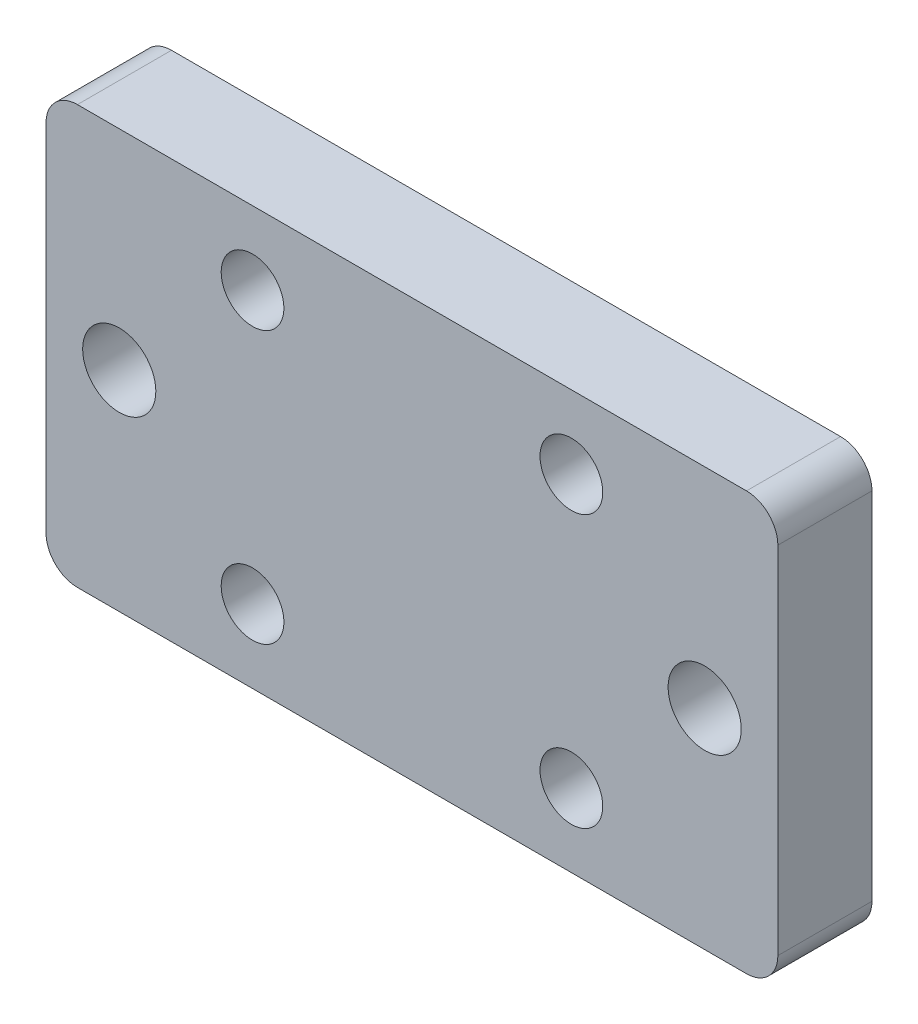
ISO-10303-21;
HEADER;
FILE_DESCRIPTION(('STEP AP214'),'2;1');
FILE_NAME('part.step','',(''),(''),'','','');
FILE_SCHEMA(('AUTOMOTIVE_DESIGN { 1 0 10303 214 1 1 1 1 }'));
ENDSEC;
DATA;
#1=APPLICATION_CONTEXT('core data for automotive mechanical design processes');
#2=APPLICATION_PROTOCOL_DEFINITION('international standard','automotive_design',2000,#1);
#3=PRODUCT_CONTEXT('',#1,'mechanical');
#4=PRODUCT('Part','Part','',(#3));
#5=PRODUCT_RELATED_PRODUCT_CATEGORY('part','',(#4));
#6=PRODUCT_DEFINITION_FORMATION('','',#4);
#7=PRODUCT_DEFINITION_CONTEXT('part definition',#1,'design');
#8=PRODUCT_DEFINITION('design','',#6,#7);
#9=PRODUCT_DEFINITION_SHAPE('','',#8);
#10=(LENGTH_UNIT() NAMED_UNIT(*) SI_UNIT(.MILLI.,.METRE.));
#11=(NAMED_UNIT(*) PLANE_ANGLE_UNIT() SI_UNIT($,.RADIAN.));
#12=(NAMED_UNIT(*) SI_UNIT($,.STERADIAN.) SOLID_ANGLE_UNIT());
#13=UNCERTAINTY_MEASURE_WITH_UNIT(LENGTH_MEASURE(1.E-05),#10,'distance_accuracy_value','');
#14=(GEOMETRIC_REPRESENTATION_CONTEXT(3) GLOBAL_UNCERTAINTY_ASSIGNED_CONTEXT((#13)) GLOBAL_UNIT_ASSIGNED_CONTEXT((#10,
#11,#12)) REPRESENTATION_CONTEXT('',''));
#15=CARTESIAN_POINT('',(0.,0.,0.));
#16=DIRECTION('',(0.,0.,1.));
#17=DIRECTION('',(1.,0.,0.));
#18=AXIS2_PLACEMENT_3D('',#15,#16,#17);
#19=CARTESIAN_POINT('',(0.,0.,9.));
#20=DIRECTION('',(1.,0.,0.));
#21=DIRECTION('',(0.,0.,-1.));
#22=AXIS2_PLACEMENT_3D('',#19,#20,#21);
#23=PLANE('',#22);
#24=DIRECTION('',(0.,-1.,0.));
#25=VECTOR('',#24,1.);
#26=CARTESIAN_POINT('',(0.,0.,9.));
#27=LINE('',#26,#25);
#28=CARTESIAN_POINT('',(0.,37.,9.));
#29=VERTEX_POINT('',#28);
#30=CARTESIAN_POINT('',(0.,3.,9.));
#31=VERTEX_POINT('',#30);
#32=EDGE_CURVE('E118',#29,#31,#27,.T.);
#33=ORIENTED_EDGE('',*,*,#32,.F.);
#34=DIRECTION('',(0.,0.,-1.));
#35=VECTOR('',#34,1.);
#36=CARTESIAN_POINT('',(0.,37.,9.));
#37=LINE('',#36,#35);
#38=CARTESIAN_POINT('',(0.,37.,0.));
#39=VERTEX_POINT('',#38);
#40=EDGE_CURVE('E103',#29,#39,#37,.T.);
#41=ORIENTED_EDGE('',*,*,#40,.T.);
#42=DIRECTION('',(0.,-1.,0.));
#43=VECTOR('',#42,1.);
#44=CARTESIAN_POINT('',(0.,0.,0.));
#45=LINE('',#44,#43);
#46=CARTESIAN_POINT('',(0.,3.,0.));
#47=VERTEX_POINT('',#46);
#48=EDGE_CURVE('E115',#39,#47,#45,.T.);
#49=ORIENTED_EDGE('',*,*,#48,.T.);
#50=DIRECTION('',(0.,0.,-1.));
#51=VECTOR('',#50,1.);
#52=CARTESIAN_POINT('',(0.,3.,9.));
#53=LINE('',#52,#51);
#54=EDGE_CURVE('E120',#47,#31,#53,.F.);
#55=ORIENTED_EDGE('',*,*,#54,.T.);
#56=EDGE_LOOP('',(#33,#41,#49,#55));
#57=FACE_BOUND('',#56,.T.);
#58=ADVANCED_FACE('F33',(#57),#23,.F.);
#59=CARTESIAN_POINT('',(0.,0.,9.));
#60=DIRECTION('',(0.,1.,0.));
#61=DIRECTION('',(0.,0.,1.));
#62=AXIS2_PLACEMENT_3D('',#59,#60,#61);
#63=PLANE('',#62);
#64=DIRECTION('',(1.,0.,0.));
#65=VECTOR('',#64,1.);
#66=CARTESIAN_POINT('',(0.,0.,0.));
#67=LINE('',#66,#65);
#68=CARTESIAN_POINT('',(3.,0.,0.));
#69=VERTEX_POINT('',#68);
#70=CARTESIAN_POINT('',(67.,0.,0.));
#71=VERTEX_POINT('',#70);
#72=EDGE_CURVE('E124',#69,#71,#67,.T.);
#73=ORIENTED_EDGE('',*,*,#72,.T.);
#74=DIRECTION('',(0.,0.,-1.));
#75=VECTOR('',#74,1.);
#76=CARTESIAN_POINT('',(67.,0.,9.));
#77=LINE('',#76,#75);
#78=CARTESIAN_POINT('',(67.,0.,9.));
#79=VERTEX_POINT('',#78);
#80=EDGE_CURVE('E11',#71,#79,#77,.F.);
#81=ORIENTED_EDGE('',*,*,#80,.T.);
#82=DIRECTION('',(1.,0.,0.));
#83=VECTOR('',#82,1.);
#84=CARTESIAN_POINT('',(0.,0.,9.));
#85=LINE('',#84,#83);
#86=CARTESIAN_POINT('',(3.,0.,9.));
#87=VERTEX_POINT('',#86);
#88=EDGE_CURVE('E164',#87,#79,#85,.T.);
#89=ORIENTED_EDGE('',*,*,#88,.F.);
#90=DIRECTION('',(0.,0.,-1.));
#91=VECTOR('',#90,1.);
#92=CARTESIAN_POINT('',(3.,0.,9.));
#93=LINE('',#92,#91);
#94=EDGE_CURVE('E41',#87,#69,#93,.T.);
#95=ORIENTED_EDGE('',*,*,#94,.T.);
#96=EDGE_LOOP('',(#73,#81,#89,#95));
#97=FACE_BOUND('',#96,.T.);
#98=ADVANCED_FACE('F162',(#97),#63,.F.);
#99=CARTESIAN_POINT('',(70.,0.,9.));
#100=DIRECTION('',(-1.,0.,0.));
#101=DIRECTION('',(0.,0.,1.));
#102=AXIS2_PLACEMENT_3D('',#99,#100,#101);
#103=PLANE('',#102);
#104=DIRECTION('',(0.,1.,0.));
#105=VECTOR('',#104,1.);
#106=CARTESIAN_POINT('',(70.,0.,0.));
#107=LINE('',#106,#105);
#108=CARTESIAN_POINT('',(70.,3.,0.));
#109=VERTEX_POINT('',#108);
#110=CARTESIAN_POINT('',(70.,37.,0.));
#111=VERTEX_POINT('',#110);
#112=EDGE_CURVE('E128',#109,#111,#107,.T.);
#113=ORIENTED_EDGE('',*,*,#112,.T.);
#114=DIRECTION('',(0.,0.,-1.));
#115=VECTOR('',#114,1.);
#116=CARTESIAN_POINT('',(70.,37.,9.));
#117=LINE('',#116,#115);
#118=CARTESIAN_POINT('',(70.,37.,9.));
#119=VERTEX_POINT('',#118);
#120=EDGE_CURVE('E48',#111,#119,#117,.F.);
#121=ORIENTED_EDGE('',*,*,#120,.T.);
#122=DIRECTION('',(0.,1.,0.));
#123=VECTOR('',#122,1.);
#124=CARTESIAN_POINT('',(70.,0.,9.));
#125=LINE('',#124,#123);
#126=CARTESIAN_POINT('',(70.,3.,9.));
#127=VERTEX_POINT('',#126);
#128=EDGE_CURVE('E172',#127,#119,#125,.T.);
#129=ORIENTED_EDGE('',*,*,#128,.F.);
#130=DIRECTION('',(0.,0.,-1.));
#131=VECTOR('',#130,1.);
#132=CARTESIAN_POINT('',(70.,3.,9.));
#133=LINE('',#132,#131);
#134=EDGE_CURVE('E155',#127,#109,#133,.T.);
#135=ORIENTED_EDGE('',*,*,#134,.T.);
#136=EDGE_LOOP('',(#113,#121,#129,#135));
#137=FACE_BOUND('',#136,.T.);
#138=ADVANCED_FACE('F171',(#137),#103,.F.);
#139=CARTESIAN_POINT('',(0.,40.,9.));
#140=DIRECTION('',(0.,-1.,0.));
#141=DIRECTION('',(0.,0.,-1.));
#142=AXIS2_PLACEMENT_3D('',#139,#140,#141);
#143=PLANE('',#142);
#144=DIRECTION('',(-1.,0.,0.));
#145=VECTOR('',#144,1.);
#146=CARTESIAN_POINT('',(0.,40.,0.));
#147=LINE('',#146,#145);
#148=CARTESIAN_POINT('',(67.,40.,0.));
#149=VERTEX_POINT('',#148);
#150=CARTESIAN_POINT('',(3.,40.,0.));
#151=VERTEX_POINT('',#150);
#152=EDGE_CURVE('E138',#149,#151,#147,.T.);
#153=ORIENTED_EDGE('',*,*,#152,.T.);
#154=DIRECTION('',(0.,0.,-1.));
#155=VECTOR('',#154,1.);
#156=CARTESIAN_POINT('',(3.,40.,9.));
#157=LINE('',#156,#155);
#158=CARTESIAN_POINT('',(3.,40.,9.));
#159=VERTEX_POINT('',#158);
#160=EDGE_CURVE('E104',#151,#159,#157,.F.);
#161=ORIENTED_EDGE('',*,*,#160,.T.);
#162=DIRECTION('',(-1.,0.,0.));
#163=VECTOR('',#162,1.);
#164=CARTESIAN_POINT('',(0.,40.,9.));
#165=LINE('',#164,#163);
#166=CARTESIAN_POINT('',(67.,40.,9.));
#167=VERTEX_POINT('',#166);
#168=EDGE_CURVE('E134',#167,#159,#165,.T.);
#169=ORIENTED_EDGE('',*,*,#168,.F.);
#170=DIRECTION('',(0.,0.,-1.));
#171=VECTOR('',#170,1.);
#172=CARTESIAN_POINT('',(67.,40.,9.));
#173=LINE('',#172,#171);
#174=EDGE_CURVE('E109',#167,#149,#173,.T.);
#175=ORIENTED_EDGE('',*,*,#174,.T.);
#176=EDGE_LOOP('',(#153,#161,#169,#175));
#177=FACE_BOUND('',#176,.T.);
#178=ADVANCED_FACE('F224',(#177),#143,.F.);
#179=CARTESIAN_POINT('',(0.,0.,9.));
#180=DIRECTION('',(0.,0.,-1.));
#181=DIRECTION('',(-1.,0.,0.));
#182=AXIS2_PLACEMENT_3D('',#179,#180,#181);
#183=PLANE('',#182);
#184=CARTESIAN_POINT('',(63.,20.,9.));
#185=DIRECTION('',(0.,0.,-1.));
#186=DIRECTION('',(-1.,0.,0.));
#187=AXIS2_PLACEMENT_3D('',#184,#185,#186);
#188=CIRCLE('',#187,3.50000000000001);
#189=CARTESIAN_POINT('',(59.5,20.,9.));
#190=VERTEX_POINT('',#189);
#191=EDGE_CURVE('E180',#190,#190,#188,.T.);
#192=ORIENTED_EDGE('',*,*,#191,.T.);
#193=EDGE_LOOP('',(#192));
#194=FACE_BOUND('',#193,.T.);
#195=CARTESIAN_POINT('',(7.,20.,9.));
#196=DIRECTION('',(0.,0.,-1.));
#197=DIRECTION('',(-1.,0.,0.));
#198=AXIS2_PLACEMENT_3D('',#195,#196,#197);
#199=CIRCLE('',#198,3.5);
#200=CARTESIAN_POINT('',(3.5,20.,9.));
#201=VERTEX_POINT('',#200);
#202=EDGE_CURVE('E183',#201,#201,#199,.T.);
#203=ORIENTED_EDGE('',*,*,#202,.T.);
#204=EDGE_LOOP('',(#203));
#205=FACE_BOUND('',#204,.T.);
#206=CARTESIAN_POINT('',(19.75,7.,9.));
#207=DIRECTION('',(0.,0.,-1.));
#208=DIRECTION('',(-1.,0.,0.));
#209=AXIS2_PLACEMENT_3D('',#206,#207,#208);
#210=CIRCLE('',#209,3.);
#211=CARTESIAN_POINT('',(16.75,7.,9.));
#212=VERTEX_POINT('',#211);
#213=EDGE_CURVE('E186',#212,#212,#210,.T.);
#214=ORIENTED_EDGE('',*,*,#213,.T.);
#215=EDGE_LOOP('',(#214));
#216=FACE_BOUND('',#215,.T.);
#217=CARTESIAN_POINT('',(50.25,7.,9.));
#218=DIRECTION('',(0.,0.,-1.));
#219=DIRECTION('',(-1.,0.,0.));
#220=AXIS2_PLACEMENT_3D('',#217,#218,#219);
#221=CIRCLE('',#220,3.);
#222=CARTESIAN_POINT('',(47.25,7.,9.));
#223=VERTEX_POINT('',#222);
#224=EDGE_CURVE('E189',#223,#223,#221,.T.);
#225=ORIENTED_EDGE('',*,*,#224,.T.);
#226=EDGE_LOOP('',(#225));
#227=FACE_BOUND('',#226,.T.);
#228=CARTESIAN_POINT('',(50.25,33.,9.));
#229=DIRECTION('',(0.,0.,-1.));
#230=DIRECTION('',(-1.,0.,0.));
#231=AXIS2_PLACEMENT_3D('',#228,#229,#230);
#232=CIRCLE('',#231,3.);
#233=CARTESIAN_POINT('',(47.25,33.,9.));
#234=VERTEX_POINT('',#233);
#235=EDGE_CURVE('E192',#234,#234,#232,.T.);
#236=ORIENTED_EDGE('',*,*,#235,.T.);
#237=EDGE_LOOP('',(#236));
#238=FACE_BOUND('',#237,.T.);
#239=CARTESIAN_POINT('',(19.75,33.,9.));
#240=DIRECTION('',(0.,0.,-1.));
#241=DIRECTION('',(-1.,0.,0.));
#242=AXIS2_PLACEMENT_3D('',#239,#240,#241);
#243=CIRCLE('',#242,3.);
#244=CARTESIAN_POINT('',(16.75,33.,9.));
#245=VERTEX_POINT('',#244);
#246=EDGE_CURVE('E125',#245,#245,#243,.T.);
#247=ORIENTED_EDGE('',*,*,#246,.T.);
#248=EDGE_LOOP('',(#247));
#249=FACE_BOUND('',#248,.T.);
#250=ORIENTED_EDGE('',*,*,#168,.T.);
#251=CARTESIAN_POINT('',(3.,37.,9.));
#252=DIRECTION('',(0.,0.,-1.));
#253=DIRECTION('',(-1.,0.,0.));
#254=AXIS2_PLACEMENT_3D('',#251,#252,#253);
#255=CIRCLE('',#254,3.);
#256=EDGE_CURVE('E153',#159,#29,#255,.F.);
#257=ORIENTED_EDGE('',*,*,#256,.T.);
#258=ORIENTED_EDGE('',*,*,#32,.T.);
#259=CARTESIAN_POINT('',(3.,3.,9.));
#260=DIRECTION('',(0.,0.,-1.));
#261=DIRECTION('',(-1.,0.,0.));
#262=AXIS2_PLACEMENT_3D('',#259,#260,#261);
#263=CIRCLE('',#262,3.);
#264=EDGE_CURVE('E148',#31,#87,#263,.F.);
#265=ORIENTED_EDGE('',*,*,#264,.T.);
#266=ORIENTED_EDGE('',*,*,#88,.T.);
#267=CARTESIAN_POINT('',(67.,3.,9.));
#268=DIRECTION('',(0.,0.,-1.));
#269=DIRECTION('',(-1.,0.,0.));
#270=AXIS2_PLACEMENT_3D('',#267,#268,#269);
#271=CIRCLE('',#270,3.);
#272=EDGE_CURVE('E55',#79,#127,#271,.F.);
#273=ORIENTED_EDGE('',*,*,#272,.T.);
#274=ORIENTED_EDGE('',*,*,#128,.T.);
#275=CARTESIAN_POINT('',(67.,37.,9.));
#276=DIRECTION('',(0.,0.,-1.));
#277=DIRECTION('',(-1.,0.,0.));
#278=AXIS2_PLACEMENT_3D('',#275,#276,#277);
#279=CIRCLE('',#278,3.);
#280=EDGE_CURVE('E151',#119,#167,#279,.F.);
#281=ORIENTED_EDGE('',*,*,#280,.T.);
#282=EDGE_LOOP('',(#250,#257,#258,#265,#266,#273,#274,#281));
#283=FACE_BOUND('',#282,.T.);
#284=ADVANCED_FACE('F221',(#194,#205,#216,#227,#238,#249,#283),#183,.F.);
#285=CARTESIAN_POINT('',(0.,0.,0.));
#286=DIRECTION('',(0.,0.,-1.));
#287=DIRECTION('',(-1.,0.,0.));
#288=AXIS2_PLACEMENT_3D('',#285,#286,#287);
#289=PLANE('',#288);
#290=CARTESIAN_POINT('',(63.,20.,0.));
#291=DIRECTION('',(0.,0.,1.));
#292=DIRECTION('',(-1.,0.,0.));
#293=AXIS2_PLACEMENT_3D('',#290,#291,#292);
#294=CIRCLE('',#293,3.50000000000001);
#295=CARTESIAN_POINT('',(59.5,20.,0.));
#296=VERTEX_POINT('',#295);
#297=EDGE_CURVE('E202',#296,#296,#294,.T.);
#298=ORIENTED_EDGE('',*,*,#297,.T.);
#299=EDGE_LOOP('',(#298));
#300=FACE_BOUND('',#299,.T.);
#301=CARTESIAN_POINT('',(7.,20.,0.));
#302=DIRECTION('',(0.,0.,1.));
#303=DIRECTION('',(1.,0.,0.));
#304=AXIS2_PLACEMENT_3D('',#301,#302,#303);
#305=CIRCLE('',#304,3.5);
#306=CARTESIAN_POINT('',(10.5,20.,0.));
#307=VERTEX_POINT('',#306);
#308=EDGE_CURVE('E205',#307,#307,#305,.T.);
#309=ORIENTED_EDGE('',*,*,#308,.T.);
#310=EDGE_LOOP('',(#309));
#311=FACE_BOUND('',#310,.T.);
#312=CARTESIAN_POINT('',(19.75,7.,0.));
#313=DIRECTION('',(0.,0.,1.));
#314=DIRECTION('',(-1.,0.,0.));
#315=AXIS2_PLACEMENT_3D('',#312,#313,#314);
#316=CIRCLE('',#315,3.);
#317=CARTESIAN_POINT('',(16.75,7.,0.));
#318=VERTEX_POINT('',#317);
#319=EDGE_CURVE('E199',#318,#318,#316,.T.);
#320=ORIENTED_EDGE('',*,*,#319,.T.);
#321=EDGE_LOOP('',(#320));
#322=FACE_BOUND('',#321,.T.);
#323=CARTESIAN_POINT('',(50.25,7.,0.));
#324=DIRECTION('',(0.,0.,1.));
#325=DIRECTION('',(1.,0.,0.));
#326=AXIS2_PLACEMENT_3D('',#323,#324,#325);
#327=CIRCLE('',#326,3.);
#328=CARTESIAN_POINT('',(53.25,7.,0.));
#329=VERTEX_POINT('',#328);
#330=EDGE_CURVE('E196',#329,#329,#327,.T.);
#331=ORIENTED_EDGE('',*,*,#330,.T.);
#332=EDGE_LOOP('',(#331));
#333=FACE_BOUND('',#332,.T.);
#334=CARTESIAN_POINT('',(50.25,33.,0.));
#335=DIRECTION('',(0.,0.,1.));
#336=DIRECTION('',(-1.,0.,0.));
#337=AXIS2_PLACEMENT_3D('',#334,#335,#336);
#338=CIRCLE('',#337,3.);
#339=CARTESIAN_POINT('',(47.25,33.,0.));
#340=VERTEX_POINT('',#339);
#341=EDGE_CURVE('E195',#340,#340,#338,.T.);
#342=ORIENTED_EDGE('',*,*,#341,.T.);
#343=EDGE_LOOP('',(#342));
#344=FACE_BOUND('',#343,.T.);
#345=CARTESIAN_POINT('',(19.75,33.,0.));
#346=DIRECTION('',(0.,0.,1.));
#347=DIRECTION('',(1.,0.,0.));
#348=AXIS2_PLACEMENT_3D('',#345,#346,#347);
#349=CIRCLE('',#348,3.);
#350=CARTESIAN_POINT('',(22.75,33.,0.));
#351=VERTEX_POINT('',#350);
#352=EDGE_CURVE('E131',#351,#351,#349,.T.);
#353=ORIENTED_EDGE('',*,*,#352,.T.);
#354=EDGE_LOOP('',(#353));
#355=FACE_BOUND('',#354,.T.);
#356=ORIENTED_EDGE('',*,*,#48,.F.);
#357=CARTESIAN_POINT('',(3.,37.,0.));
#358=DIRECTION('',(0.,0.,-1.));
#359=DIRECTION('',(-1.,0.,0.));
#360=AXIS2_PLACEMENT_3D('',#357,#358,#359);
#361=CIRCLE('',#360,3.);
#362=EDGE_CURVE('E99',#39,#151,#361,.T.);
#363=ORIENTED_EDGE('',*,*,#362,.T.);
#364=ORIENTED_EDGE('',*,*,#152,.F.);
#365=CARTESIAN_POINT('',(67.,37.,0.));
#366=DIRECTION('',(0.,0.,-1.));
#367=DIRECTION('',(-1.,0.,0.));
#368=AXIS2_PLACEMENT_3D('',#365,#366,#367);
#369=CIRCLE('',#368,3.);
#370=EDGE_CURVE('E110',#149,#111,#369,.T.);
#371=ORIENTED_EDGE('',*,*,#370,.T.);
#372=ORIENTED_EDGE('',*,*,#112,.F.);
#373=CARTESIAN_POINT('',(67.,3.,0.));
#374=DIRECTION('',(0.,0.,-1.));
#375=DIRECTION('',(-1.,0.,0.));
#376=AXIS2_PLACEMENT_3D('',#373,#374,#375);
#377=CIRCLE('',#376,3.);
#378=EDGE_CURVE('E142',#109,#71,#377,.T.);
#379=ORIENTED_EDGE('',*,*,#378,.T.);
#380=ORIENTED_EDGE('',*,*,#72,.F.);
#381=CARTESIAN_POINT('',(3.,3.,0.));
#382=DIRECTION('',(0.,0.,-1.));
#383=DIRECTION('',(-1.,0.,0.));
#384=AXIS2_PLACEMENT_3D('',#381,#382,#383);
#385=CIRCLE('',#384,3.);
#386=EDGE_CURVE('E119',#69,#47,#385,.T.);
#387=ORIENTED_EDGE('',*,*,#386,.T.);
#388=EDGE_LOOP('',(#356,#363,#364,#371,#372,#379,#380,#387));
#389=FACE_BOUND('',#388,.T.);
#390=ADVANCED_FACE('F122',(#300,#311,#322,#333,#344,#355,#389),#289,.T.);
#391=CARTESIAN_POINT('',(19.75,33.,0.));
#392=DIRECTION('',(0.,0.,1.));
#393=DIRECTION('',(1.,0.,0.));
#394=AXIS2_PLACEMENT_3D('',#391,#392,#393);
#395=CYLINDRICAL_SURFACE('',#394,3.);
#396=ORIENTED_EDGE('',*,*,#352,.F.);
#397=EDGE_LOOP('',(#396));
#398=FACE_BOUND('',#397,.T.);
#399=ORIENTED_EDGE('',*,*,#246,.F.);
#400=EDGE_LOOP('',(#399));
#401=FACE_BOUND('',#400,.T.);
#402=ADVANCED_FACE('F257',(#398,#401),#395,.F.);
#403=CARTESIAN_POINT('',(50.25,33.,0.));
#404=DIRECTION('',(0.,0.,1.));
#405=DIRECTION('',(1.,0.,0.));
#406=AXIS2_PLACEMENT_3D('',#403,#404,#405);
#407=CYLINDRICAL_SURFACE('',#406,3.);
#408=ORIENTED_EDGE('',*,*,#341,.F.);
#409=EDGE_LOOP('',(#408));
#410=FACE_BOUND('',#409,.T.);
#411=ORIENTED_EDGE('',*,*,#235,.F.);
#412=EDGE_LOOP('',(#411));
#413=FACE_BOUND('',#412,.T.);
#414=ADVANCED_FACE('F262',(#410,#413),#407,.F.);
#415=CARTESIAN_POINT('',(50.25,7.,0.));
#416=DIRECTION('',(0.,0.,1.));
#417=DIRECTION('',(1.,0.,0.));
#418=AXIS2_PLACEMENT_3D('',#415,#416,#417);
#419=CYLINDRICAL_SURFACE('',#418,3.);
#420=ORIENTED_EDGE('',*,*,#330,.F.);
#421=EDGE_LOOP('',(#420));
#422=FACE_BOUND('',#421,.T.);
#423=ORIENTED_EDGE('',*,*,#224,.F.);
#424=EDGE_LOOP('',(#423));
#425=FACE_BOUND('',#424,.T.);
#426=ADVANCED_FACE('F217',(#422,#425),#419,.F.);
#427=CARTESIAN_POINT('',(19.75,7.,0.));
#428=DIRECTION('',(0.,0.,1.));
#429=DIRECTION('',(1.,0.,0.));
#430=AXIS2_PLACEMENT_3D('',#427,#428,#429);
#431=CYLINDRICAL_SURFACE('',#430,3.);
#432=ORIENTED_EDGE('',*,*,#319,.F.);
#433=EDGE_LOOP('',(#432));
#434=FACE_BOUND('',#433,.T.);
#435=ORIENTED_EDGE('',*,*,#213,.F.);
#436=EDGE_LOOP('',(#435));
#437=FACE_BOUND('',#436,.T.);
#438=ADVANCED_FACE('F213',(#434,#437),#431,.F.);
#439=CARTESIAN_POINT('',(7.,20.,0.));
#440=DIRECTION('',(0.,0.,1.));
#441=DIRECTION('',(1.,0.,0.));
#442=AXIS2_PLACEMENT_3D('',#439,#440,#441);
#443=CYLINDRICAL_SURFACE('',#442,3.5);
#444=ORIENTED_EDGE('',*,*,#308,.F.);
#445=EDGE_LOOP('',(#444));
#446=FACE_BOUND('',#445,.T.);
#447=ORIENTED_EDGE('',*,*,#202,.F.);
#448=EDGE_LOOP('',(#447));
#449=FACE_BOUND('',#448,.T.);
#450=ADVANCED_FACE('F216',(#446,#449),#443,.F.);
#451=CARTESIAN_POINT('',(63.,20.,0.));
#452=DIRECTION('',(0.,0.,1.));
#453=DIRECTION('',(1.,0.,0.));
#454=AXIS2_PLACEMENT_3D('',#451,#452,#453);
#455=CYLINDRICAL_SURFACE('',#454,3.50000000000001);
#456=ORIENTED_EDGE('',*,*,#297,.F.);
#457=EDGE_LOOP('',(#456));
#458=FACE_BOUND('',#457,.T.);
#459=ORIENTED_EDGE('',*,*,#191,.F.);
#460=EDGE_LOOP('',(#459));
#461=FACE_BOUND('',#460,.T.);
#462=ADVANCED_FACE('F243',(#458,#461),#455,.F.);
#463=CARTESIAN_POINT('',(3.,37.,9.));
#464=DIRECTION('',(0.,0.,-1.));
#465=DIRECTION('',(-1.,0.,0.));
#466=AXIS2_PLACEMENT_3D('',#463,#464,#465);
#467=CYLINDRICAL_SURFACE('',#466,3.);
#468=ORIENTED_EDGE('',*,*,#256,.F.);
#469=ORIENTED_EDGE('',*,*,#160,.F.);
#470=ORIENTED_EDGE('',*,*,#362,.F.);
#471=ORIENTED_EDGE('',*,*,#40,.F.);
#472=EDGE_LOOP('',(#468,#469,#470,#471));
#473=FACE_BOUND('',#472,.T.);
#474=ADVANCED_FACE('F102',(#473),#467,.T.);
#475=CARTESIAN_POINT('',(67.,37.,9.));
#476=DIRECTION('',(0.,0.,-1.));
#477=DIRECTION('',(-1.,0.,0.));
#478=AXIS2_PLACEMENT_3D('',#475,#476,#477);
#479=CYLINDRICAL_SURFACE('',#478,3.);
#480=ORIENTED_EDGE('',*,*,#280,.F.);
#481=ORIENTED_EDGE('',*,*,#120,.F.);
#482=ORIENTED_EDGE('',*,*,#370,.F.);
#483=ORIENTED_EDGE('',*,*,#174,.F.);
#484=EDGE_LOOP('',(#480,#481,#482,#483));
#485=FACE_BOUND('',#484,.T.);
#486=ADVANCED_FACE('F236',(#485),#479,.T.);
#487=CARTESIAN_POINT('',(67.,3.,9.));
#488=DIRECTION('',(0.,0.,-1.));
#489=DIRECTION('',(-1.,0.,0.));
#490=AXIS2_PLACEMENT_3D('',#487,#488,#489);
#491=CYLINDRICAL_SURFACE('',#490,3.);
#492=ORIENTED_EDGE('',*,*,#272,.F.);
#493=ORIENTED_EDGE('',*,*,#80,.F.);
#494=ORIENTED_EDGE('',*,*,#378,.F.);
#495=ORIENTED_EDGE('',*,*,#134,.F.);
#496=EDGE_LOOP('',(#492,#493,#494,#495));
#497=FACE_BOUND('',#496,.T.);
#498=ADVANCED_FACE('F170',(#497),#491,.T.);
#499=CARTESIAN_POINT('',(3.,3.,9.));
#500=DIRECTION('',(0.,0.,-1.));
#501=DIRECTION('',(-1.,0.,0.));
#502=AXIS2_PLACEMENT_3D('',#499,#500,#501);
#503=CYLINDRICAL_SURFACE('',#502,3.);
#504=ORIENTED_EDGE('',*,*,#264,.F.);
#505=ORIENTED_EDGE('',*,*,#54,.F.);
#506=ORIENTED_EDGE('',*,*,#386,.F.);
#507=ORIENTED_EDGE('',*,*,#94,.F.);
#508=EDGE_LOOP('',(#504,#505,#506,#507));
#509=FACE_BOUND('',#508,.T.);
#510=ADVANCED_FACE('F35',(#509),#503,.T.);
#511=CLOSED_SHELL('',(#58,#98,#138,#178,#284,#390,#402,#414,#426,#438,#450,#462,#474,#486,#498,#510));
#512=MANIFOLD_SOLID_BREP('B2',#511);
#513=ADVANCED_BREP_SHAPE_REPRESENTATION('',(#18,#512),#14);
#514=SHAPE_DEFINITION_REPRESENTATION(#9,#513);
ENDSEC;
END-ISO-10303-21;
